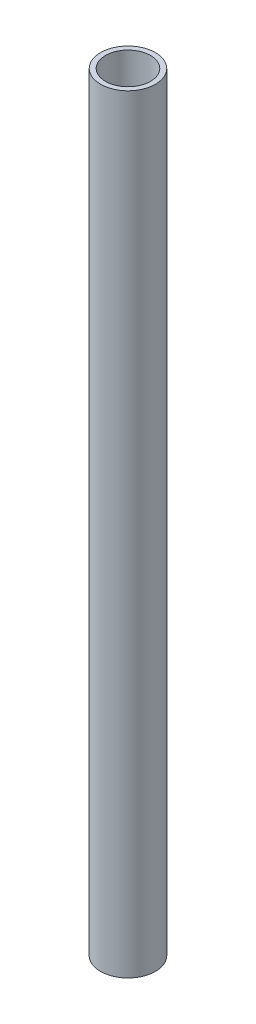
ISO-10303-21;
HEADER;
FILE_DESCRIPTION(('STEP AP214'),'2;1');
FILE_NAME('part.step','',(''),(''),'','','');
FILE_SCHEMA(('AUTOMOTIVE_DESIGN { 1 0 10303 214 1 1 1 1 }'));
ENDSEC;
DATA;
#1=APPLICATION_CONTEXT('core data for automotive mechanical design processes');
#2=APPLICATION_PROTOCOL_DEFINITION('international standard','automotive_design',2000,#1);
#3=PRODUCT_CONTEXT('',#1,'mechanical');
#4=PRODUCT('Part','Part','',(#3));
#5=PRODUCT_RELATED_PRODUCT_CATEGORY('part','',(#4));
#6=PRODUCT_DEFINITION_FORMATION('','',#4);
#7=PRODUCT_DEFINITION_CONTEXT('part definition',#1,'design');
#8=PRODUCT_DEFINITION('design','',#6,#7);
#9=PRODUCT_DEFINITION_SHAPE('','',#8);
#10=(LENGTH_UNIT() NAMED_UNIT(*) SI_UNIT(.MILLI.,.METRE.));
#11=(NAMED_UNIT(*) PLANE_ANGLE_UNIT() SI_UNIT($,.RADIAN.));
#12=(NAMED_UNIT(*) SI_UNIT($,.STERADIAN.) SOLID_ANGLE_UNIT());
#13=UNCERTAINTY_MEASURE_WITH_UNIT(LENGTH_MEASURE(1.E-05),#10,'distance_accuracy_value','');
#14=(GEOMETRIC_REPRESENTATION_CONTEXT(3) GLOBAL_UNCERTAINTY_ASSIGNED_CONTEXT((#13)) GLOBAL_UNIT_ASSIGNED_CONTEXT((#10,
#11,#12)) REPRESENTATION_CONTEXT('',''));
#15=CARTESIAN_POINT('',(0.,0.,0.));
#16=DIRECTION('',(0.,0.,1.));
#17=DIRECTION('',(1.,0.,0.));
#18=AXIS2_PLACEMENT_3D('',#15,#16,#17);
#19=CARTESIAN_POINT('',(0.,355.6,0.));
#20=DIRECTION('',(0.,1.,0.));
#21=DIRECTION('',(0.,0.,1.));
#22=AXIS2_PLACEMENT_3D('',#19,#20,#21);
#23=PLANE('',#22);
#24=CARTESIAN_POINT('',(0.,355.6,0.));
#25=DIRECTION('',(0.,1.,0.));
#26=DIRECTION('',(0.,0.,1.));
#27=AXIS2_PLACEMENT_3D('',#24,#25,#26);
#28=CIRCLE('',#27,12.7);
#29=CARTESIAN_POINT('',(0.,355.6,12.7));
#30=VERTEX_POINT('',#29);
#31=EDGE_CURVE('E10',#30,#30,#28,.T.);
#32=ORIENTED_EDGE('',*,*,#31,.T.);
#33=EDGE_LOOP('',(#32));
#34=FACE_BOUND('',#33,.T.);
#35=CARTESIAN_POINT('',(0.,355.6,0.));
#36=DIRECTION('',(0.,1.,0.));
#37=DIRECTION('',(0.,0.,1.));
#38=AXIS2_PLACEMENT_3D('',#35,#36,#37);
#39=CIRCLE('',#38,10.414);
#40=CARTESIAN_POINT('',(0.,355.6,10.414));
#41=VERTEX_POINT('',#40);
#42=EDGE_CURVE('E42',#41,#41,#39,.T.);
#43=ORIENTED_EDGE('',*,*,#42,.F.);
#44=EDGE_LOOP('',(#43));
#45=FACE_BOUND('',#44,.T.);
#46=ADVANCED_FACE('F31',(#34,#45),#23,.T.);
#47=CARTESIAN_POINT('',(0.,0.,0.));
#48=DIRECTION('',(0.,1.,0.));
#49=DIRECTION('',(0.,0.,1.));
#50=AXIS2_PLACEMENT_3D('',#47,#48,#49);
#51=PLANE('',#50);
#52=CARTESIAN_POINT('',(0.,0.,0.));
#53=DIRECTION('',(0.,1.,0.));
#54=DIRECTION('',(0.,0.,1.));
#55=AXIS2_PLACEMENT_3D('',#52,#53,#54);
#56=CIRCLE('',#55,12.7);
#57=CARTESIAN_POINT('',(0.,0.,12.7));
#58=VERTEX_POINT('',#57);
#59=EDGE_CURVE('E35',#58,#58,#56,.T.);
#60=ORIENTED_EDGE('',*,*,#59,.F.);
#61=EDGE_LOOP('',(#60));
#62=FACE_BOUND('',#61,.T.);
#63=CARTESIAN_POINT('',(0.,0.,0.));
#64=DIRECTION('',(0.,1.,0.));
#65=DIRECTION('',(0.,0.,1.));
#66=AXIS2_PLACEMENT_3D('',#63,#64,#65);
#67=CIRCLE('',#66,10.414);
#68=CARTESIAN_POINT('',(0.,0.,10.414));
#69=VERTEX_POINT('',#68);
#70=EDGE_CURVE('E44',#69,#69,#67,.T.);
#71=ORIENTED_EDGE('',*,*,#70,.T.);
#72=EDGE_LOOP('',(#71));
#73=FACE_BOUND('',#72,.T.);
#74=ADVANCED_FACE('F54',(#62,#73),#51,.F.);
#75=CARTESIAN_POINT('',(0.,355.6,0.));
#76=DIRECTION('',(0.,-1.,0.));
#77=DIRECTION('',(0.,0.,-1.));
#78=AXIS2_PLACEMENT_3D('',#75,#76,#77);
#79=CYLINDRICAL_SURFACE('',#78,12.7);
#80=ORIENTED_EDGE('',*,*,#31,.F.);
#81=EDGE_LOOP('',(#80));
#82=FACE_BOUND('',#81,.T.);
#83=ORIENTED_EDGE('',*,*,#59,.T.);
#84=EDGE_LOOP('',(#83));
#85=FACE_BOUND('',#84,.T.);
#86=ADVANCED_FACE('F33',(#82,#85),#79,.T.);
#87=CARTESIAN_POINT('',(0.,355.6,0.));
#88=DIRECTION('',(0.,-1.,0.));
#89=DIRECTION('',(0.,0.,-1.));
#90=AXIS2_PLACEMENT_3D('',#87,#88,#89);
#91=CYLINDRICAL_SURFACE('',#90,10.414);
#92=ORIENTED_EDGE('',*,*,#42,.T.);
#93=EDGE_LOOP('',(#92));
#94=FACE_BOUND('',#93,.T.);
#95=ORIENTED_EDGE('',*,*,#70,.F.);
#96=EDGE_LOOP('',(#95));
#97=FACE_BOUND('',#96,.T.);
#98=ADVANCED_FACE('F50',(#94,#97),#91,.F.);
#99=CLOSED_SHELL('',(#46,#74,#86,#98));
#100=MANIFOLD_SOLID_BREP('B2',#99);
#101=ADVANCED_BREP_SHAPE_REPRESENTATION('',(#18,#100),#14);
#102=SHAPE_DEFINITION_REPRESENTATION(#9,#101);
ENDSEC;
END-ISO-10303-21;
